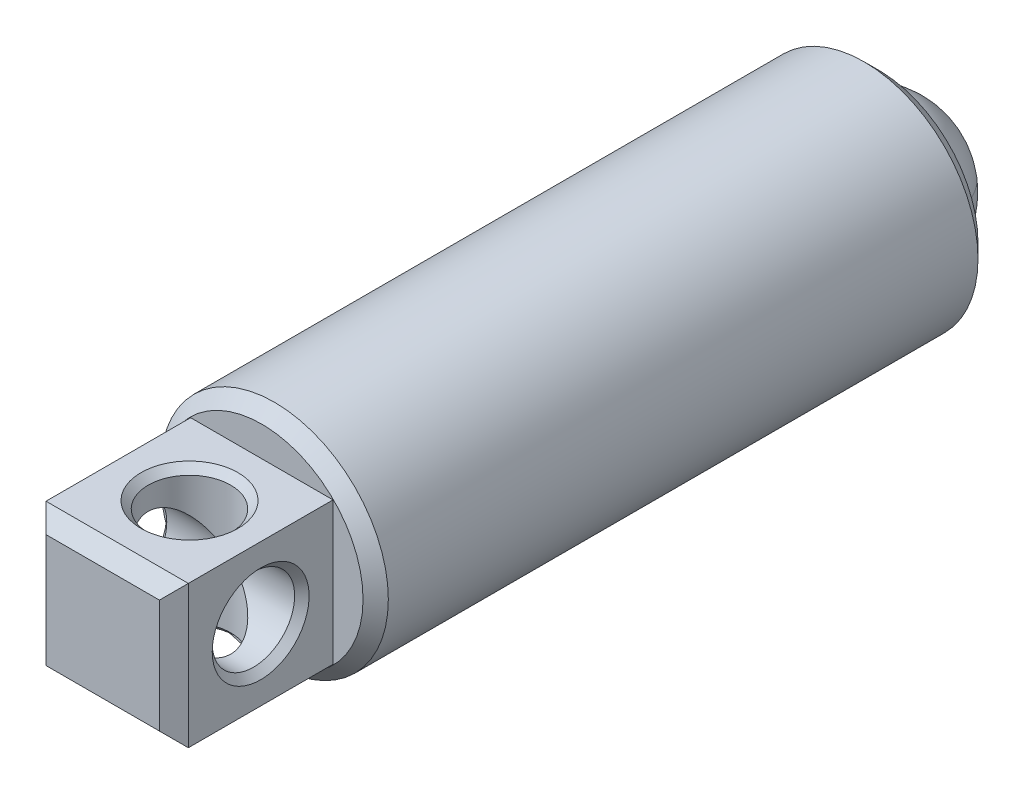
ISO-10303-21;
HEADER;
FILE_DESCRIPTION(('STEP AP214'),'2;1');
FILE_NAME('part.step','',(''),(''),'','','');
FILE_SCHEMA(('AUTOMOTIVE_DESIGN { 1 0 10303 214 1 1 1 1 }'));
ENDSEC;
DATA;
#1=APPLICATION_CONTEXT('core data for automotive mechanical design processes');
#2=APPLICATION_PROTOCOL_DEFINITION('international standard','automotive_design',2000,#1);
#3=PRODUCT_CONTEXT('',#1,'mechanical');
#4=PRODUCT('Part','Part','',(#3));
#5=PRODUCT_RELATED_PRODUCT_CATEGORY('part','',(#4));
#6=PRODUCT_DEFINITION_FORMATION('','',#4);
#7=PRODUCT_DEFINITION_CONTEXT('part definition',#1,'design');
#8=PRODUCT_DEFINITION('design','',#6,#7);
#9=PRODUCT_DEFINITION_SHAPE('','',#8);
#10=(LENGTH_UNIT() NAMED_UNIT(*) SI_UNIT(.MILLI.,.METRE.));
#11=(NAMED_UNIT(*) PLANE_ANGLE_UNIT() SI_UNIT($,.RADIAN.));
#12=(NAMED_UNIT(*) SI_UNIT($,.STERADIAN.) SOLID_ANGLE_UNIT());
#13=UNCERTAINTY_MEASURE_WITH_UNIT(LENGTH_MEASURE(1.E-05),#10,'distance_accuracy_value','');
#14=(GEOMETRIC_REPRESENTATION_CONTEXT(3) GLOBAL_UNCERTAINTY_ASSIGNED_CONTEXT((#13)) GLOBAL_UNIT_ASSIGNED_CONTEXT((#10,
#11,#12)) REPRESENTATION_CONTEXT('',''));
#15=CARTESIAN_POINT('',(0.,0.,0.));
#16=DIRECTION('',(0.,0.,1.));
#17=DIRECTION('',(1.,0.,0.));
#18=AXIS2_PLACEMENT_3D('',#15,#16,#17);
#19=CARTESIAN_POINT('',(1.6625129625254,-2.46036743646982,-3.2258856071015));
#20=DIRECTION('',(-0.167753244592774,0.985829016071548,0.));
#21=DIRECTION('',(-0.985829016071548,-0.167753244592774,0.));
#22=AXIS2_PLACEMENT_3D('',#19,#20,#21);
#23=SPHERICAL_SURFACE('',#22,1.3890625);
#24=CARTESIAN_POINT('',(1.6625129625254,-2.46036743646982,-3.2258856071015));
#25=DIRECTION('',(0.167753244592774,-0.985829016071548,0.));
#26=DIRECTION('',(0.,0.,-1.));
#27=AXIS2_PLACEMENT_3D('',#24,#25,#26);
#28=CIRCLE('',#27,1.3890625);
#29=CARTESIAN_POINT('',(0.293134844888513,-2.69338717778697,-3.2258856071015));
#30=VERTEX_POINT('',#29);
#31=CARTESIAN_POINT('',(3.03189108016228,-2.22734769515267,-3.2258856071015));
#32=VERTEX_POINT('',#31);
#33=EDGE_CURVE('P0_E38',#30,#32,#28,.T.);
#34=ORIENTED_EDGE('',*,*,#33,.T.);
#35=CARTESIAN_POINT('',(1.6625129625254,-2.46036743646982,-3.2258856071015));
#36=DIRECTION('',(0.,0.,-1.));
#37=DIRECTION('',(-0.985829016071548,-0.167753244592774,0.));
#38=AXIS2_PLACEMENT_3D('',#35,#36,#37);
#39=CIRCLE('',#38,1.3890625);
#40=EDGE_CURVE('P0_E11',#32,#30,#39,.T.);
#41=ORIENTED_EDGE('',*,*,#40,.T.);
#42=EDGE_LOOP('',(#34,#41));
#43=FACE_BOUND('',#42,.T.);
#44=ADVANCED_FACE('P0_F16',(#43),#23,.T.);
#45=ORIENTED_EDGE('',*,*,#33,.F.);
#46=CARTESIAN_POINT('',(1.6625129625254,-2.46036743646982,-3.2258856071015));
#47=DIRECTION('',(0.,0.,-1.));
#48=DIRECTION('',(-0.985829016071548,-0.167753244592774,0.));
#49=AXIS2_PLACEMENT_3D('',#46,#47,#48);
#50=CIRCLE('',#49,1.3890625);
#51=EDGE_CURVE('P0_E23',#30,#32,#50,.T.);
#52=ORIENTED_EDGE('',*,*,#51,.T.);
#53=EDGE_LOOP('',(#45,#52));
#54=FACE_BOUND('',#53,.T.);
#55=ADVANCED_FACE('P0_F37',(#54),#23,.T.);
#56=ORIENTED_EDGE('',*,*,#40,.F.);
#57=EDGE_CURVE('P0_E34',#32,#30,#28,.T.);
#58=ORIENTED_EDGE('',*,*,#57,.T.);
#59=EDGE_LOOP('',(#56,#58));
#60=FACE_BOUND('',#59,.T.);
#61=ADVANCED_FACE('P0_F32',(#60),#23,.T.);
#62=ORIENTED_EDGE('',*,*,#51,.F.);
#63=ORIENTED_EDGE('',*,*,#57,.F.);
#64=EDGE_LOOP('',(#62,#63));
#65=FACE_BOUND('',#64,.T.);
#66=ADVANCED_FACE('P0_F18',(#65),#23,.T.);
#67=CLOSED_SHELL('',(#44,#55,#61,#66));
#68=MANIFOLD_SOLID_BREP('P0_B1',#67);
#69=CARTESIAN_POINT('',(-0.337483037474602,-2.46036743646982,8.6550518928985));
#70=DIRECTION('',(1.,0.,0.));
#71=DIRECTION('',(0.,0.,-1.));
#72=AXIS2_PLACEMENT_3D('',#69,#70,#71);
#73=CYLINDRICAL_SURFACE('',#72,0.7239);
#74=CARTESIAN_POINT('',(2.7855129625254,-2.46036743646982,8.6550518928985));
#75=DIRECTION('',(-1.,0.,0.));
#76=DIRECTION('',(0.,0.,1.));
#77=AXIS2_PLACEMENT_3D('',#74,#75,#76);
#78=CIRCLE('',#77,0.7239);
#79=CARTESIAN_POINT('',(2.7855129625254,-2.46036743646982,9.3789518928985));
#80=VERTEX_POINT('',#79);
#81=EDGE_CURVE('P1_E119',#80,#80,#78,.F.);
#82=ORIENTED_EDGE('',*,*,#81,.T.);
#83=EDGE_LOOP('',(#82));
#84=FACE_BOUND('',#83,.T.);
#85=CARTESIAN_POINT('',(1.6625129625254,-2.46036743646982,8.6550518928985));
#86=DIRECTION('',(0.707106781186547,-0.707106781186547,0.));
#87=DIRECTION('',(0.707106781186547,0.707106781186547,0.));
#88=AXIS2_PLACEMENT_3D('',#85,#86,#87);
#89=ELLIPSE('',#88,1.02374919780188,0.7239);
#90=CARTESIAN_POINT('',(1.6625129625254,-2.46036743646982,9.3789518928985));
#91=VERTEX_POINT('',#90);
#92=CARTESIAN_POINT('',(1.6625129625254,-2.46036743646982,7.9311518928985));
#93=VERTEX_POINT('',#92);
#94=EDGE_CURVE('P1_E86',#91,#93,#89,.F.);
#95=ORIENTED_EDGE('',*,*,#94,.T.);
#96=CARTESIAN_POINT('',(1.6625129625254,-2.46036743646982,8.6550518928985));
#97=DIRECTION('',(0.707106781186547,0.707106781186547,0.));
#98=DIRECTION('',(0.707106781186547,-0.707106781186547,0.));
#99=AXIS2_PLACEMENT_3D('',#96,#97,#98);
#100=ELLIPSE('',#99,1.02374919780188,0.7239);
#101=EDGE_CURVE('P1_E82',#93,#91,#100,.F.);
#102=ORIENTED_EDGE('',*,*,#101,.T.);
#103=EDGE_LOOP('',(#95,#102));
#104=FACE_BOUND('',#103,.T.);
#105=ADVANCED_FACE('P1_F15',(#84,#104),#73,.F.);
#106=CARTESIAN_POINT('',(1.6625129625254,-0.682367436469824,7.3850518928985));
#107=DIRECTION('',(0.,0.,-1.));
#108=DIRECTION('',(-1.,0.,0.));
#109=AXIS2_PLACEMENT_3D('',#106,#107,#108);
#110=PLANE('',#109);
#111=CARTESIAN_POINT('',(1.6625129625254,-2.46036743646982,7.3850518928985));
#112=DIRECTION('',(0.,0.,1.));
#113=DIRECTION('',(1.,0.,0.));
#114=AXIS2_PLACEMENT_3D('',#111,#112,#113);
#115=CIRCLE('',#114,1.778);
#116=CARTESIAN_POINT('',(3.4405129625254,-2.46036743646982,7.3850518928985));
#117=VERTEX_POINT('',#116);
#118=EDGE_CURVE('P1_E178',#117,#117,#115,.T.);
#119=ORIENTED_EDGE('',*,*,#118,.T.);
#120=EDGE_LOOP('',(#119));
#121=FACE_BOUND('',#120,.T.);
#122=DIRECTION('',(0.,1.,0.));
#123=VECTOR('',#122,1.);
#124=CARTESIAN_POINT('',(2.9125129625254,-3.71036743646982,7.3850518928985));
#125=LINE('',#124,#123);
#126=CARTESIAN_POINT('',(2.9125129625254,-3.71036743646982,7.3850518928985));
#127=VERTEX_POINT('',#126);
#128=CARTESIAN_POINT('',(2.9125129625254,-1.21036743646982,7.3850518928985));
#129=VERTEX_POINT('',#128);
#130=EDGE_CURVE('P1_E152',#127,#129,#125,.T.);
#131=ORIENTED_EDGE('',*,*,#130,.F.);
#132=DIRECTION('',(1.,0.,0.));
#133=VECTOR('',#132,1.);
#134=CARTESIAN_POINT('',(0.412512962525397,-3.71036743646982,7.3850518928985));
#135=LINE('',#134,#133);
#136=CARTESIAN_POINT('',(0.412512962525397,-3.71036743646982,7.3850518928985));
#137=VERTEX_POINT('',#136);
#138=EDGE_CURVE('P1_E167',#137,#127,#135,.T.);
#139=ORIENTED_EDGE('',*,*,#138,.F.);
#140=DIRECTION('',(0.,-1.,0.));
#141=VECTOR('',#140,1.);
#142=CARTESIAN_POINT('',(0.412512962525397,-3.71036743646982,7.3850518928985));
#143=LINE('',#142,#141);
#144=CARTESIAN_POINT('',(0.412512962525397,-1.21036743646982,7.3850518928985));
#145=VERTEX_POINT('',#144);
#146=EDGE_CURVE('P1_E162',#145,#137,#143,.T.);
#147=ORIENTED_EDGE('',*,*,#146,.F.);
#148=DIRECTION('',(-1.,0.,0.));
#149=VECTOR('',#148,1.);
#150=CARTESIAN_POINT('',(0.412512962525397,-1.21036743646982,7.3850518928985));
#151=LINE('',#150,#149);
#152=EDGE_CURVE('P1_E157',#129,#145,#151,.T.);
#153=ORIENTED_EDGE('',*,*,#152,.F.);
#154=EDGE_LOOP('',(#131,#139,#147,#153));
#155=FACE_BOUND('',#154,.T.);
#156=ADVANCED_FACE('P1_F195',(#121,#155),#110,.F.);
#157=CARTESIAN_POINT('',(1.6625129625254,-2.46036743646982,-1.26145458061761));
#158=DIRECTION('',(0.,0.,-1.));
#159=DIRECTION('',(-1.,0.,0.));
#160=AXIS2_PLACEMENT_3D('',#157,#158,#159);
#161=CONICAL_SURFACE('',#160,0.,0.785398163397444);
#162=CARTESIAN_POINT('',(1.6625129625254,-2.46036743646982,-2.65845458061763));
#163=DIRECTION('',(0.,0.,1.));
#164=DIRECTION('',(1.,0.,0.));
#165=AXIS2_PLACEMENT_3D('',#162,#163,#164);
#166=CIRCLE('',#165,1.397);
#167=CARTESIAN_POINT('',(3.0595129625254,-2.46036743646982,-2.65845458061763));
#168=VERTEX_POINT('',#167);
#169=EDGE_CURVE('P1_E92',#168,#168,#166,.T.);
#170=ORIENTED_EDGE('',*,*,#169,.F.);
#171=EDGE_LOOP('',(#170));
#172=FACE_BOUND('',#171,.T.);
#173=CARTESIAN_POINT('',(1.6625129625254,-2.46036743646982,-1.26145458061761));
#174=VERTEX_POINT('',#173);
#175=VERTEX_LOOP('',#174);
#176=FACE_BOUND('',#175,.T.);
#177=ADVANCED_FACE('P1_F192',(#172,#176),#161,.F.);
#178=CARTESIAN_POINT('',(1.6625129625254,-2.46036743646982,7.3850518928985));
#179=DIRECTION('',(0.,0.,1.));
#180=DIRECTION('',(1.,0.,0.));
#181=AXIS2_PLACEMENT_3D('',#178,#179,#180);
#182=CYLINDRICAL_SURFACE('',#181,1.397);
#183=CARTESIAN_POINT('',(1.6625129625254,-2.46036743646982,-3.4465481071015));
#184=DIRECTION('',(0.,0.,1.));
#185=DIRECTION('',(1.,0.,0.));
#186=AXIS2_PLACEMENT_3D('',#183,#184,#185);
#187=CIRCLE('',#186,1.397);
#188=CARTESIAN_POINT('',(3.0595129625254,-2.46036743646982,-3.4465481071015));
#189=VERTEX_POINT('',#188);
#190=EDGE_CURVE('P1_E184',#189,#189,#187,.T.);
#191=ORIENTED_EDGE('',*,*,#190,.F.);
#192=EDGE_LOOP('',(#191));
#193=FACE_BOUND('',#192,.T.);
#194=ORIENTED_EDGE('',*,*,#169,.T.);
#195=EDGE_LOOP('',(#194));
#196=FACE_BOUND('',#195,.T.);
#197=ADVANCED_FACE('P1_F190',(#193,#196),#182,.F.);
#198=CARTESIAN_POINT('',(1.6625129625254,-0.460371436469824,-3.4465481071015));
#199=DIRECTION('',(0.,0.,1.));
#200=DIRECTION('',(1.,0.,0.));
#201=AXIS2_PLACEMENT_3D('',#198,#199,#200);
#202=PLANE('',#201);
#203=CARTESIAN_POINT('',(1.6625129625254,-2.46036743646982,-3.4465481071015));
#204=DIRECTION('',(0.,0.,1.));
#205=DIRECTION('',(1.,0.,0.));
#206=AXIS2_PLACEMENT_3D('',#203,#204,#205);
#207=CIRCLE('',#206,1.74599599999999);
#208=CARTESIAN_POINT('',(3.40850896252539,-2.46036743646982,-3.4465481071015));
#209=VERTEX_POINT('',#208);
#210=EDGE_CURVE('P1_E101',#209,#209,#207,.F.);
#211=ORIENTED_EDGE('',*,*,#210,.T.);
#212=EDGE_LOOP('',(#211));
#213=FACE_BOUND('',#212,.T.);
#214=ORIENTED_EDGE('',*,*,#190,.T.);
#215=EDGE_LOOP('',(#214));
#216=FACE_BOUND('',#215,.T.);
#217=ADVANCED_FACE('P1_F202',(#213,#216),#202,.F.);
#218=CARTESIAN_POINT('',(1.6625129625254,-2.46036743646982,7.3850518928985));
#219=DIRECTION('',(0.,0.,1.));
#220=DIRECTION('',(1.,0.,0.));
#221=AXIS2_PLACEMENT_3D('',#218,#219,#220);
#222=CYLINDRICAL_SURFACE('',#221,1.999996);
#223=CARTESIAN_POINT('',(1.6625129625254,-2.46036743646982,-3.1925481071015));
#224=DIRECTION('',(0.,0.,1.));
#225=DIRECTION('',(1.,0.,0.));
#226=AXIS2_PLACEMENT_3D('',#223,#224,#225);
#227=CIRCLE('',#226,1.999996);
#228=CARTESIAN_POINT('',(3.6625089625254,-2.46036743646982,-3.1925481071015));
#229=VERTEX_POINT('',#228);
#230=EDGE_CURVE('P1_E94',#229,#229,#227,.T.);
#231=ORIENTED_EDGE('',*,*,#230,.T.);
#232=EDGE_LOOP('',(#231));
#233=FACE_BOUND('',#232,.T.);
#234=CARTESIAN_POINT('',(1.6625129625254,-2.46036743646982,7.1630558928985));
#235=DIRECTION('',(0.,0.,1.));
#236=DIRECTION('',(1.,0.,0.));
#237=AXIS2_PLACEMENT_3D('',#234,#235,#236);
#238=CIRCLE('',#237,1.999996);
#239=CARTESIAN_POINT('',(3.6625089625254,-2.46036743646982,7.1630558928985));
#240=VERTEX_POINT('',#239);
#241=EDGE_CURVE('P1_E181',#240,#240,#238,.T.);
#242=ORIENTED_EDGE('',*,*,#241,.F.);
#243=EDGE_LOOP('',(#242));
#244=FACE_BOUND('',#243,.T.);
#245=ADVANCED_FACE('P1_F285',(#233,#244),#222,.T.);
#246=CARTESIAN_POINT('',(1.6625129625254,-2.46036743646982,7.1630558928985));
#247=DIRECTION('',(0.,0.,-1.));
#248=DIRECTION('',(-1.,0.,0.));
#249=AXIS2_PLACEMENT_3D('',#246,#247,#248);
#250=CONICAL_SURFACE('',#249,1.999996,0.78539816339745);
#251=ORIENTED_EDGE('',*,*,#118,.F.);
#252=EDGE_LOOP('',(#251));
#253=FACE_BOUND('',#252,.T.);
#254=ORIENTED_EDGE('',*,*,#241,.T.);
#255=EDGE_LOOP('',(#254));
#256=FACE_BOUND('',#255,.T.);
#257=ADVANCED_FACE('P1_F288',(#253,#256),#250,.T.);
#258=CARTESIAN_POINT('',(2.9125129625254,-3.71036743646982,10.1790518928985));
#259=DIRECTION('',(-1.,0.,0.));
#260=DIRECTION('',(0.,0.,1.));
#261=AXIS2_PLACEMENT_3D('',#258,#259,#260);
#262=PLANE('',#261);
#263=CARTESIAN_POINT('',(2.9125129625254,-2.46036743646982,8.6550518928985));
#264=DIRECTION('',(-1.,0.,0.));
#265=DIRECTION('',(0.,0.,1.));
#266=AXIS2_PLACEMENT_3D('',#263,#264,#265);
#267=CIRCLE('',#266,0.850900000000001);
#268=CARTESIAN_POINT('',(2.9125129625254,-2.46036743646982,9.5059518928985));
#269=VERTEX_POINT('',#268);
#270=EDGE_CURVE('P1_E116',#269,#269,#267,.T.);
#271=ORIENTED_EDGE('',*,*,#270,.T.);
#272=EDGE_LOOP('',(#271));
#273=FACE_BOUND('',#272,.T.);
#274=DIRECTION('',(0.,0.,-1.));
#275=VECTOR('',#274,1.);
#276=CARTESIAN_POINT('',(2.9125129625254,-1.21036743646982,10.1790518928985));
#277=LINE('',#276,#275);
#278=CARTESIAN_POINT('',(2.9125129625254,-1.21036743646982,9.9250518928985));
#279=VERTEX_POINT('',#278);
#280=EDGE_CURVE('P1_E176',#279,#129,#277,.T.);
#281=ORIENTED_EDGE('',*,*,#280,.F.);
#282=DIRECTION('',(0.,-1.,0.));
#283=VECTOR('',#282,1.);
#284=CARTESIAN_POINT('',(2.9125129625254,-3.71036743646982,9.9250518928985));
#285=LINE('',#284,#283);
#286=CARTESIAN_POINT('',(2.9125129625254,-3.71036743646982,9.9250518928985));
#287=VERTEX_POINT('',#286);
#288=EDGE_CURVE('P1_E10',#279,#287,#285,.T.);
#289=ORIENTED_EDGE('',*,*,#288,.T.);
#290=DIRECTION('',(0.,0.,-1.));
#291=VECTOR('',#290,1.);
#292=CARTESIAN_POINT('',(2.9125129625254,-3.71036743646982,10.1790518928985));
#293=LINE('',#292,#291);
#294=EDGE_CURVE('P1_E170',#287,#127,#293,.T.);
#295=ORIENTED_EDGE('',*,*,#294,.T.);
#296=ORIENTED_EDGE('',*,*,#130,.T.);
#297=EDGE_LOOP('',(#281,#289,#295,#296));
#298=FACE_BOUND('',#297,.T.);
#299=ADVANCED_FACE('P1_F245',(#273,#298),#262,.F.);
#300=CARTESIAN_POINT('',(0.412512962525397,-1.21036743646982,10.1790518928985));
#301=DIRECTION('',(0.,-1.,0.));
#302=DIRECTION('',(0.,0.,-1.));
#303=AXIS2_PLACEMENT_3D('',#300,#301,#302);
#304=PLANE('',#303);
#305=CARTESIAN_POINT('',(1.6625129625254,-1.21036743646982,8.6550518928985));
#306=DIRECTION('',(0.,-1.,0.));
#307=DIRECTION('',(0.,0.,-1.));
#308=AXIS2_PLACEMENT_3D('',#305,#306,#307);
#309=CIRCLE('',#308,0.850900000000002);
#310=CARTESIAN_POINT('',(1.6625129625254,-1.21036743646982,7.8041518928985));
#311=VERTEX_POINT('',#310);
#312=EDGE_CURVE('P1_E122',#311,#311,#309,.T.);
#313=ORIENTED_EDGE('',*,*,#312,.T.);
#314=EDGE_LOOP('',(#313));
#315=FACE_BOUND('',#314,.T.);
#316=DIRECTION('',(0.,0.,-1.));
#317=VECTOR('',#316,1.);
#318=CARTESIAN_POINT('',(0.412512962525397,-1.21036743646982,10.1790518928985));
#319=LINE('',#318,#317);
#320=CARTESIAN_POINT('',(0.412512962525397,-1.21036743646982,9.9250518928985));
#321=VERTEX_POINT('',#320);
#322=EDGE_CURVE('P1_E174',#321,#145,#319,.T.);
#323=ORIENTED_EDGE('',*,*,#322,.F.);
#324=DIRECTION('',(1.,0.,0.));
#325=VECTOR('',#324,1.);
#326=CARTESIAN_POINT('',(0.412512962525397,-1.21036743646982,9.9250518928985));
#327=LINE('',#326,#325);
#328=EDGE_CURVE('P1_E24',#321,#279,#327,.T.);
#329=ORIENTED_EDGE('',*,*,#328,.T.);
#330=ORIENTED_EDGE('',*,*,#280,.T.);
#331=ORIENTED_EDGE('',*,*,#152,.T.);
#332=EDGE_LOOP('',(#323,#329,#330,#331));
#333=FACE_BOUND('',#332,.T.);
#334=ADVANCED_FACE('P1_F236',(#315,#333),#304,.F.);
#335=CARTESIAN_POINT('',(0.412512962525397,-3.71036743646982,10.1790518928985));
#336=DIRECTION('',(1.,0.,0.));
#337=DIRECTION('',(0.,0.,-1.));
#338=AXIS2_PLACEMENT_3D('',#335,#336,#337);
#339=PLANE('',#338);
#340=CARTESIAN_POINT('',(0.412512962525397,-2.46036743646982,8.6550518928985));
#341=DIRECTION('',(1.,0.,0.));
#342=DIRECTION('',(0.,0.,-1.));
#343=AXIS2_PLACEMENT_3D('',#340,#341,#342);
#344=CIRCLE('',#343,0.850900000000001);
#345=CARTESIAN_POINT('',(0.412512962525397,-2.46036743646982,7.8041518928985));
#346=VERTEX_POINT('',#345);
#347=EDGE_CURVE('P1_E104',#346,#346,#344,.T.);
#348=ORIENTED_EDGE('',*,*,#347,.T.);
#349=EDGE_LOOP('',(#348));
#350=FACE_BOUND('',#349,.T.);
#351=DIRECTION('',(0.,0.,-1.));
#352=VECTOR('',#351,1.);
#353=CARTESIAN_POINT('',(0.412512962525397,-3.71036743646982,10.1790518928985));
#354=LINE('',#353,#352);
#355=CARTESIAN_POINT('',(0.412512962525397,-3.71036743646982,9.9250518928985));
#356=VERTEX_POINT('',#355);
#357=EDGE_CURVE('P1_E172',#356,#137,#354,.T.);
#358=ORIENTED_EDGE('',*,*,#357,.F.);
#359=DIRECTION('',(0.,1.,0.));
#360=VECTOR('',#359,1.);
#361=CARTESIAN_POINT('',(0.412512962525397,-3.71036743646982,9.9250518928985));
#362=LINE('',#361,#360);
#363=EDGE_CURVE('P1_E39',#356,#321,#362,.T.);
#364=ORIENTED_EDGE('',*,*,#363,.T.);
#365=ORIENTED_EDGE('',*,*,#322,.T.);
#366=ORIENTED_EDGE('',*,*,#146,.T.);
#367=EDGE_LOOP('',(#358,#364,#365,#366));
#368=FACE_BOUND('',#367,.T.);
#369=ADVANCED_FACE('P1_F234',(#350,#368),#339,.F.);
#370=CARTESIAN_POINT('',(0.412512962525397,-3.71036743646982,10.1790518928985));
#371=DIRECTION('',(0.,1.,0.));
#372=DIRECTION('',(0.,0.,1.));
#373=AXIS2_PLACEMENT_3D('',#370,#371,#372);
#374=PLANE('',#373);
#375=CARTESIAN_POINT('',(1.6625129625254,-3.71036743646982,8.6550518928985));
#376=DIRECTION('',(0.,1.,0.));
#377=DIRECTION('',(0.,0.,1.));
#378=AXIS2_PLACEMENT_3D('',#375,#376,#377);
#379=CIRCLE('',#378,0.8509);
#380=CARTESIAN_POINT('',(1.6625129625254,-3.71036743646982,9.5059518928985));
#381=VERTEX_POINT('',#380);
#382=EDGE_CURVE('P1_E110',#381,#381,#379,.T.);
#383=ORIENTED_EDGE('',*,*,#382,.T.);
#384=EDGE_LOOP('',(#383));
#385=FACE_BOUND('',#384,.T.);
#386=ORIENTED_EDGE('',*,*,#294,.F.);
#387=DIRECTION('',(-1.,0.,0.));
#388=VECTOR('',#387,1.);
#389=CARTESIAN_POINT('',(0.412512962525397,-3.71036743646982,9.9250518928985));
#390=LINE('',#389,#388);
#391=EDGE_CURVE('P1_E137',#287,#356,#390,.T.);
#392=ORIENTED_EDGE('',*,*,#391,.T.);
#393=ORIENTED_EDGE('',*,*,#357,.T.);
#394=ORIENTED_EDGE('',*,*,#138,.T.);
#395=EDGE_LOOP('',(#386,#392,#393,#394));
#396=FACE_BOUND('',#395,.T.);
#397=ADVANCED_FACE('P1_F222',(#385,#396),#374,.F.);
#398=CARTESIAN_POINT('',(1.6625129625254,-2.46036743646982,10.1790518928985));
#399=DIRECTION('',(0.,0.,-1.));
#400=DIRECTION('',(-1.,0.,0.));
#401=AXIS2_PLACEMENT_3D('',#398,#399,#400);
#402=PLANE('',#401);
#403=DIRECTION('',(0.,-1.,0.));
#404=VECTOR('',#403,1.);
#405=CARTESIAN_POINT('',(0.666512962525396,-2.46036743646982,10.1790518928985));
#406=LINE('',#405,#404);
#407=CARTESIAN_POINT('',(0.666512962525396,-1.46436743646982,10.1790518928985));
#408=VERTEX_POINT('',#407);
#409=CARTESIAN_POINT('',(0.666512962525396,-3.45636743646982,10.1790518928985));
#410=VERTEX_POINT('',#409);
#411=EDGE_CURVE('P1_E132',#408,#410,#406,.T.);
#412=ORIENTED_EDGE('',*,*,#411,.T.);
#413=DIRECTION('',(1.,0.,0.));
#414=VECTOR('',#413,1.);
#415=CARTESIAN_POINT('',(1.6625129625254,-3.45636743646982,10.1790518928985));
#416=LINE('',#415,#414);
#417=CARTESIAN_POINT('',(2.6585129625254,-3.45636743646982,10.1790518928985));
#418=VERTEX_POINT('',#417);
#419=EDGE_CURVE('P1_E134',#410,#418,#416,.T.);
#420=ORIENTED_EDGE('',*,*,#419,.T.);
#421=DIRECTION('',(0.,1.,0.));
#422=VECTOR('',#421,1.);
#423=CARTESIAN_POINT('',(2.6585129625254,-2.46036743646982,10.1790518928985));
#424=LINE('',#423,#422);
#425=CARTESIAN_POINT('',(2.6585129625254,-1.46436743646982,10.1790518928985));
#426=VERTEX_POINT('',#425);
#427=EDGE_CURVE('P1_E128',#418,#426,#424,.T.);
#428=ORIENTED_EDGE('',*,*,#427,.T.);
#429=DIRECTION('',(-1.,0.,0.));
#430=VECTOR('',#429,1.);
#431=CARTESIAN_POINT('',(1.6625129625254,-1.46436743646982,10.1790518928985));
#432=LINE('',#431,#430);
#433=EDGE_CURVE('P1_E130',#426,#408,#432,.T.);
#434=ORIENTED_EDGE('',*,*,#433,.T.);
#435=EDGE_LOOP('',(#412,#420,#428,#434));
#436=FACE_BOUND('',#435,.T.);
#437=ADVANCED_FACE('P1_F215',(#436),#402,.F.);
#438=CARTESIAN_POINT('',(0.539512962525398,-2.46036743646982,8.6550518928985));
#439=DIRECTION('',(1.,0.,0.));
#440=DIRECTION('',(0.,0.,-1.));
#441=AXIS2_PLACEMENT_3D('',#438,#439,#440);
#442=CIRCLE('',#441,0.7239);
#443=CARTESIAN_POINT('',(0.539512962525398,-2.46036743646982,7.9311518928985));
#444=VERTEX_POINT('',#443);
#445=EDGE_CURVE('P1_E107',#444,#444,#442,.F.);
#446=ORIENTED_EDGE('',*,*,#445,.T.);
#447=EDGE_LOOP('',(#446));
#448=FACE_BOUND('',#447,.T.);
#449=CARTESIAN_POINT('',(1.6625129625254,-2.46036743646982,8.6550518928985));
#450=DIRECTION('',(0.707106781186547,-0.707106781186547,0.));
#451=DIRECTION('',(0.707106781186547,0.707106781186547,0.));
#452=AXIS2_PLACEMENT_3D('',#449,#450,#451);
#453=ELLIPSE('',#452,1.02374919780188,0.7239);
#454=EDGE_CURVE('P1_E78',#91,#93,#453,.T.);
#455=ORIENTED_EDGE('',*,*,#454,.T.);
#456=CARTESIAN_POINT('',(1.6625129625254,-2.46036743646982,8.6550518928985));
#457=DIRECTION('',(0.707106781186547,0.707106781186547,0.));
#458=DIRECTION('',(0.707106781186547,-0.707106781186547,0.));
#459=AXIS2_PLACEMENT_3D('',#456,#457,#458);
#460=ELLIPSE('',#459,1.02374919780188,0.7239);
#461=EDGE_CURVE('P1_E85',#93,#91,#460,.T.);
#462=ORIENTED_EDGE('',*,*,#461,.T.);
#463=EDGE_LOOP('',(#455,#462));
#464=FACE_BOUND('',#463,.T.);
#465=ADVANCED_FACE('P1_F96',(#448,#464),#73,.F.);
#466=CARTESIAN_POINT('',(1.6625129625254,-4.46036343646982,8.6550518928985));
#467=DIRECTION('',(0.,1.,0.));
#468=DIRECTION('',(0.,0.,1.));
#469=AXIS2_PLACEMENT_3D('',#466,#467,#468);
#470=CYLINDRICAL_SURFACE('',#469,0.7239);
#471=CARTESIAN_POINT('',(1.6625129625254,-1.33736743646982,8.6550518928985));
#472=DIRECTION('',(0.,-1.,0.));
#473=DIRECTION('',(0.,0.,-1.));
#474=AXIS2_PLACEMENT_3D('',#471,#472,#473);
#475=CIRCLE('',#474,0.7239);
#476=CARTESIAN_POINT('',(1.6625129625254,-1.33736743646982,7.9311518928985));
#477=VERTEX_POINT('',#476);
#478=EDGE_CURVE('P1_E125',#477,#477,#475,.F.);
#479=ORIENTED_EDGE('',*,*,#478,.T.);
#480=EDGE_LOOP('',(#479));
#481=FACE_BOUND('',#480,.T.);
#482=ORIENTED_EDGE('',*,*,#94,.F.);
#483=ORIENTED_EDGE('',*,*,#461,.F.);
#484=EDGE_LOOP('',(#482,#483));
#485=FACE_BOUND('',#484,.T.);
#486=ADVANCED_FACE('P1_F90',(#481,#485),#470,.F.);
#487=CARTESIAN_POINT('',(1.6625129625254,-3.58336743646982,8.6550518928985));
#488=DIRECTION('',(0.,1.,0.));
#489=DIRECTION('',(0.,0.,1.));
#490=AXIS2_PLACEMENT_3D('',#487,#488,#489);
#491=CIRCLE('',#490,0.7239);
#492=CARTESIAN_POINT('',(1.6625129625254,-3.58336743646982,9.3789518928985));
#493=VERTEX_POINT('',#492);
#494=EDGE_CURVE('P1_E113',#493,#493,#491,.F.);
#495=ORIENTED_EDGE('',*,*,#494,.T.);
#496=EDGE_LOOP('',(#495));
#497=FACE_BOUND('',#496,.T.);
#498=ORIENTED_EDGE('',*,*,#454,.F.);
#499=ORIENTED_EDGE('',*,*,#101,.F.);
#500=EDGE_LOOP('',(#498,#499));
#501=FACE_BOUND('',#500,.T.);
#502=ADVANCED_FACE('P1_F80',(#497,#501),#470,.F.);
#503=CARTESIAN_POINT('',(1.6625129625254,-2.46036743646982,-3.1925481071015));
#504=DIRECTION('',(0.,0.,1.));
#505=DIRECTION('',(1.,0.,0.));
#506=AXIS2_PLACEMENT_3D('',#503,#504,#505);
#507=CONICAL_SURFACE('',#506,1.999996,0.785398163397454);
#508=ORIENTED_EDGE('',*,*,#210,.F.);
#509=EDGE_LOOP('',(#508));
#510=FACE_BOUND('',#509,.T.);
#511=ORIENTED_EDGE('',*,*,#230,.F.);
#512=EDGE_LOOP('',(#511));
#513=FACE_BOUND('',#512,.T.);
#514=ADVANCED_FACE('P1_F230',(#510,#513),#507,.T.);
#515=CARTESIAN_POINT('',(0.412512962525397,-2.46036743646982,8.6550518928985));
#516=DIRECTION('',(-1.,0.,0.));
#517=DIRECTION('',(0.,0.,1.));
#518=AXIS2_PLACEMENT_3D('',#515,#516,#517);
#519=CONICAL_SURFACE('',#518,0.850900000000001,0.78539816339745);
#520=ORIENTED_EDGE('',*,*,#445,.F.);
#521=EDGE_LOOP('',(#520));
#522=FACE_BOUND('',#521,.T.);
#523=ORIENTED_EDGE('',*,*,#347,.F.);
#524=EDGE_LOOP('',(#523));
#525=FACE_BOUND('',#524,.T.);
#526=ADVANCED_FACE('P1_F226',(#522,#525),#519,.F.);
#527=CARTESIAN_POINT('',(1.6625129625254,-3.71036743646982,8.6550518928985));
#528=DIRECTION('',(0.,-1.,0.));
#529=DIRECTION('',(0.,0.,-1.));
#530=AXIS2_PLACEMENT_3D('',#527,#528,#529);
#531=CONICAL_SURFACE('',#530,0.8509,0.785398163397451);
#532=ORIENTED_EDGE('',*,*,#494,.F.);
#533=EDGE_LOOP('',(#532));
#534=FACE_BOUND('',#533,.T.);
#535=ORIENTED_EDGE('',*,*,#382,.F.);
#536=EDGE_LOOP('',(#535));
#537=FACE_BOUND('',#536,.T.);
#538=ADVANCED_FACE('P1_F229',(#534,#537),#531,.F.);
#539=CARTESIAN_POINT('',(2.9125129625254,-2.46036743646982,8.6550518928985));
#540=DIRECTION('',(1.,0.,0.));
#541=DIRECTION('',(0.,0.,-1.));
#542=AXIS2_PLACEMENT_3D('',#539,#540,#541);
#543=CONICAL_SURFACE('',#542,0.850900000000002,0.78539816339745);
#544=ORIENTED_EDGE('',*,*,#81,.F.);
#545=EDGE_LOOP('',(#544));
#546=FACE_BOUND('',#545,.T.);
#547=ORIENTED_EDGE('',*,*,#270,.F.);
#548=EDGE_LOOP('',(#547));
#549=FACE_BOUND('',#548,.T.);
#550=ADVANCED_FACE('P1_F267',(#546,#549),#543,.F.);
#551=CARTESIAN_POINT('',(1.6625129625254,-1.21036743646982,8.6550518928985));
#552=DIRECTION('',(0.,1.,0.));
#553=DIRECTION('',(0.,0.,1.));
#554=AXIS2_PLACEMENT_3D('',#551,#552,#553);
#555=CONICAL_SURFACE('',#554,0.850900000000001,0.785398163397451);
#556=ORIENTED_EDGE('',*,*,#478,.F.);
#557=EDGE_LOOP('',(#556));
#558=FACE_BOUND('',#557,.T.);
#559=ORIENTED_EDGE('',*,*,#312,.F.);
#560=EDGE_LOOP('',(#559));
#561=FACE_BOUND('',#560,.T.);
#562=ADVANCED_FACE('P1_F261',(#558,#561),#555,.F.);
#563=CARTESIAN_POINT('',(1.6625129625254,-1.46436743646982,10.1790518928985));
#564=DIRECTION('',(0.,-0.707106781186548,-0.707106781186548));
#565=DIRECTION('',(-1.,0.,0.));
#566=AXIS2_PLACEMENT_3D('',#563,#564,#565);
#567=PLANE('',#566);
#568=DIRECTION('',(-0.577350269189626,-0.577350269189626,0.577350269189626));
#569=VECTOR('',#568,1.);
#570=CARTESIAN_POINT('',(2.3265129625254,-1.79636743646982,10.5110518928985));
#571=LINE('',#570,#569);
#572=EDGE_CURVE('P1_E145',#279,#426,#571,.T.);
#573=ORIENTED_EDGE('',*,*,#572,.F.);
#574=ORIENTED_EDGE('',*,*,#328,.F.);
#575=DIRECTION('',(0.577350269189626,-0.577350269189626,0.577350269189626));
#576=VECTOR('',#575,1.);
#577=CARTESIAN_POINT('',(0.998512962525397,-1.79636743646982,10.5110518928985));
#578=LINE('',#577,#576);
#579=EDGE_CURVE('P1_E19',#408,#321,#578,.F.);
#580=ORIENTED_EDGE('',*,*,#579,.F.);
#581=ORIENTED_EDGE('',*,*,#433,.F.);
#582=EDGE_LOOP('',(#573,#574,#580,#581));
#583=FACE_BOUND('',#582,.T.);
#584=ADVANCED_FACE('P1_F17',(#583),#567,.F.);
#585=CARTESIAN_POINT('',(0.666512962525396,-2.46036743646982,10.1790518928985));
#586=DIRECTION('',(0.707106781186548,0.,-0.707106781186548));
#587=DIRECTION('',(0.,-1.,0.));
#588=AXIS2_PLACEMENT_3D('',#585,#586,#587);
#589=PLANE('',#588);
#590=ORIENTED_EDGE('',*,*,#579,.T.);
#591=ORIENTED_EDGE('',*,*,#363,.F.);
#592=DIRECTION('',(0.577350269189626,0.577350269189626,0.577350269189626));
#593=VECTOR('',#592,1.);
#594=CARTESIAN_POINT('',(0.998512962525396,-3.12436743646982,10.5110518928985));
#595=LINE('',#594,#593);
#596=EDGE_CURVE('P1_E144',#410,#356,#595,.F.);
#597=ORIENTED_EDGE('',*,*,#596,.F.);
#598=ORIENTED_EDGE('',*,*,#411,.F.);
#599=EDGE_LOOP('',(#590,#591,#597,#598));
#600=FACE_BOUND('',#599,.T.);
#601=ADVANCED_FACE('P1_F254',(#600),#589,.F.);
#602=CARTESIAN_POINT('',(2.6585129625254,-2.46036743646982,10.1790518928985));
#603=DIRECTION('',(-0.707106781186548,0.,-0.707106781186548));
#604=DIRECTION('',(0.,1.,0.));
#605=AXIS2_PLACEMENT_3D('',#602,#603,#604);
#606=PLANE('',#605);
#607=ORIENTED_EDGE('',*,*,#572,.T.);
#608=ORIENTED_EDGE('',*,*,#427,.F.);
#609=DIRECTION('',(0.577350269189626,-0.577350269189626,-0.577350269189626));
#610=VECTOR('',#609,1.);
#611=CARTESIAN_POINT('',(2.3265129625254,-3.12436743646982,10.5110518928985));
#612=LINE('',#611,#610);
#613=EDGE_CURVE('P1_E142',#287,#418,#612,.F.);
#614=ORIENTED_EDGE('',*,*,#613,.F.);
#615=ORIENTED_EDGE('',*,*,#288,.F.);
#616=EDGE_LOOP('',(#607,#608,#614,#615));
#617=FACE_BOUND('',#616,.T.);
#618=ADVANCED_FACE('P1_F249',(#617),#606,.F.);
#619=CARTESIAN_POINT('',(1.6625129625254,-3.45636743646982,10.1790518928985));
#620=DIRECTION('',(0.,0.707106781186548,-0.707106781186548));
#621=DIRECTION('',(1.,0.,0.));
#622=AXIS2_PLACEMENT_3D('',#619,#620,#621);
#623=PLANE('',#622);
#624=ORIENTED_EDGE('',*,*,#596,.T.);
#625=ORIENTED_EDGE('',*,*,#391,.F.);
#626=ORIENTED_EDGE('',*,*,#613,.T.);
#627=ORIENTED_EDGE('',*,*,#419,.F.);
#628=EDGE_LOOP('',(#624,#625,#626,#627));
#629=FACE_BOUND('',#628,.T.);
#630=ADVANCED_FACE('P1_F252',(#629),#623,.F.);
#631=CLOSED_SHELL('',(#105,#156,#177,#197,#217,#245,#257,#299,#334,#369,#397,#437,#465,#486,
#502,#514,#526,#538,#550,#562,#584,#601,#618,#630));
#632=MANIFOLD_SOLID_BREP('P1_B1',#631);
#633=ADVANCED_BREP_SHAPE_REPRESENTATION('',(#18,#68,#632),#14);
#634=SHAPE_DEFINITION_REPRESENTATION(#9,#633);
ENDSEC;
END-ISO-10303-21;
